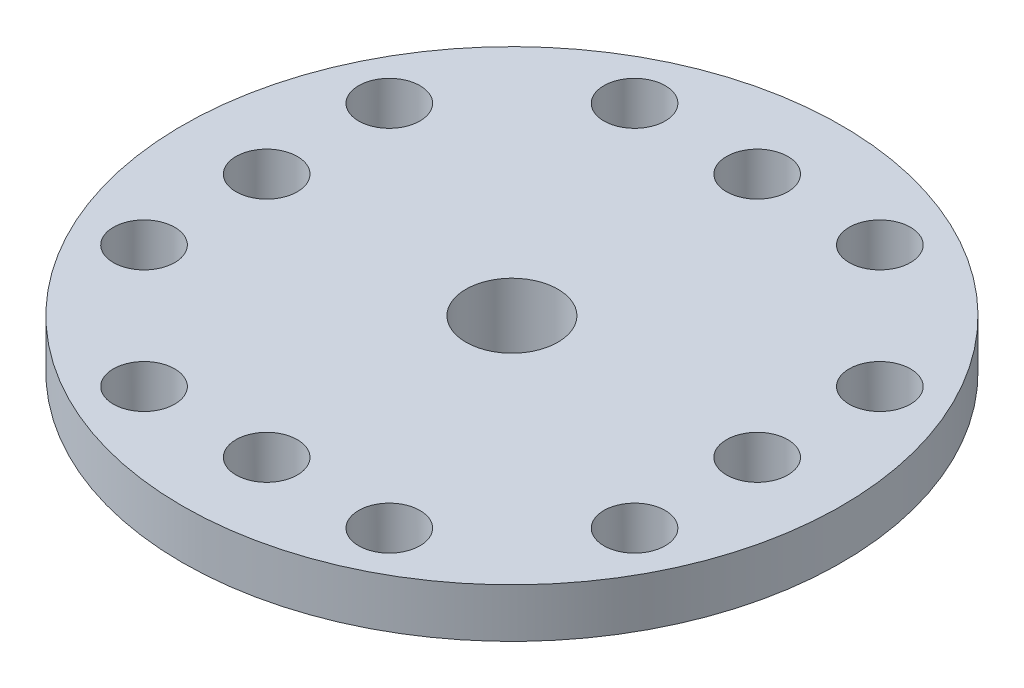
ISO-10303-21;
HEADER;
FILE_DESCRIPTION(('STEP AP214'),'2;1');
FILE_NAME('part.step','',(''),(''),'','','');
FILE_SCHEMA(('AUTOMOTIVE_DESIGN { 1 0 10303 214 1 1 1 1 }'));
ENDSEC;
DATA;
#1=APPLICATION_CONTEXT('core data for automotive mechanical design processes');
#2=APPLICATION_PROTOCOL_DEFINITION('international standard','automotive_design',2000,#1);
#3=PRODUCT_CONTEXT('',#1,'mechanical');
#4=PRODUCT('Part','Part','',(#3));
#5=PRODUCT_RELATED_PRODUCT_CATEGORY('part','',(#4));
#6=PRODUCT_DEFINITION_FORMATION('','',#4);
#7=PRODUCT_DEFINITION_CONTEXT('part definition',#1,'design');
#8=PRODUCT_DEFINITION('design','',#6,#7);
#9=PRODUCT_DEFINITION_SHAPE('','',#8);
#10=(LENGTH_UNIT() NAMED_UNIT(*) SI_UNIT(.MILLI.,.METRE.));
#11=(NAMED_UNIT(*) PLANE_ANGLE_UNIT() SI_UNIT($,.RADIAN.));
#12=(NAMED_UNIT(*) SI_UNIT($,.STERADIAN.) SOLID_ANGLE_UNIT());
#13=UNCERTAINTY_MEASURE_WITH_UNIT(LENGTH_MEASURE(1.E-05),#10,'distance_accuracy_value','');
#14=(GEOMETRIC_REPRESENTATION_CONTEXT(3) GLOBAL_UNCERTAINTY_ASSIGNED_CONTEXT((#13)) GLOBAL_UNIT_ASSIGNED_CONTEXT((#10,
#11,#12)) REPRESENTATION_CONTEXT('',''));
#15=CARTESIAN_POINT('',(0.,0.,0.));
#16=DIRECTION('',(0.,0.,1.));
#17=DIRECTION('',(1.,0.,0.));
#18=AXIS2_PLACEMENT_3D('',#15,#16,#17);
#19=CARTESIAN_POINT('',(0.,0.,0.));
#20=DIRECTION('',(0.,1.,0.));
#21=DIRECTION('',(0.,0.,1.));
#22=AXIS2_PLACEMENT_3D('',#19,#20,#21);
#23=CYLINDRICAL_SURFACE('',#22,1.25);
#24=CARTESIAN_POINT('',(0.,4.5,0.));
#25=DIRECTION('',(0.,1.,0.));
#26=DIRECTION('',(0.,0.,1.));
#27=AXIS2_PLACEMENT_3D('',#24,#25,#26);
#28=CIRCLE('',#27,1.25);
#29=CARTESIAN_POINT('',(0.,4.5,1.25));
#30=VERTEX_POINT('',#29);
#31=EDGE_CURVE('E50',#30,#30,#28,.F.);
#32=ORIENTED_EDGE('',*,*,#31,.F.);
#33=EDGE_LOOP('',(#32));
#34=FACE_BOUND('',#33,.T.);
#35=CARTESIAN_POINT('',(0.,3.5,0.));
#36=DIRECTION('',(0.,-1.,0.));
#37=DIRECTION('',(0.,0.,-1.));
#38=AXIS2_PLACEMENT_3D('',#35,#36,#37);
#39=CIRCLE('',#38,1.25);
#40=CARTESIAN_POINT('',(0.,3.5,-1.25));
#41=VERTEX_POINT('',#40);
#42=EDGE_CURVE('E36',#41,#41,#39,.F.);
#43=ORIENTED_EDGE('',*,*,#42,.F.);
#44=EDGE_LOOP('',(#43));
#45=FACE_BOUND('',#44,.T.);
#46=ADVANCED_FACE('F32',(#34,#45),#23,.F.);
#47=CARTESIAN_POINT('',(0.,7.5,0.));
#48=DIRECTION('',(0.,-1.,0.));
#49=DIRECTION('',(0.,0.,-1.));
#50=AXIS2_PLACEMENT_3D('',#47,#48,#49);
#51=CYLINDRICAL_SURFACE('',#50,6.);
#52=CARTESIAN_POINT('',(0.,7.5,0.));
#53=DIRECTION('',(0.,1.,0.));
#54=DIRECTION('',(0.,0.,1.));
#55=AXIS2_PLACEMENT_3D('',#52,#53,#54);
#56=CIRCLE('',#55,6.);
#57=CARTESIAN_POINT('',(0.,7.5,6.));
#58=VERTEX_POINT('',#57);
#59=EDGE_CURVE('E10',#58,#58,#56,.T.);
#60=ORIENTED_EDGE('',*,*,#59,.F.);
#61=EDGE_LOOP('',(#60));
#62=FACE_BOUND('',#61,.T.);
#63=CARTESIAN_POINT('',(0.,0.,0.));
#64=DIRECTION('',(0.,1.,0.));
#65=DIRECTION('',(0.,0.,1.));
#66=AXIS2_PLACEMENT_3D('',#63,#64,#65);
#67=CIRCLE('',#66,6.);
#68=CARTESIAN_POINT('',(0.,0.,6.));
#69=VERTEX_POINT('',#68);
#70=EDGE_CURVE('E40',#69,#69,#67,.T.);
#71=ORIENTED_EDGE('',*,*,#70,.T.);
#72=EDGE_LOOP('',(#71));
#73=FACE_BOUND('',#72,.T.);
#74=ADVANCED_FACE('F34',(#62,#73),#51,.T.);
#75=CARTESIAN_POINT('',(0.,0.,0.));
#76=DIRECTION('',(0.,1.,0.));
#77=DIRECTION('',(0.,0.,1.));
#78=AXIS2_PLACEMENT_3D('',#75,#76,#77);
#79=PLANE('',#78);
#80=CARTESIAN_POINT('',(0.,0.,0.));
#81=DIRECTION('',(0.,-1.,0.));
#82=DIRECTION('',(0.,0.,-1.));
#83=AXIS2_PLACEMENT_3D('',#80,#81,#82);
#84=CIRCLE('',#83,3.);
#85=CARTESIAN_POINT('',(0.,0.,-3.));
#86=VERTEX_POINT('',#85);
#87=EDGE_CURVE('E67',#86,#86,#84,.T.);
#88=ORIENTED_EDGE('',*,*,#87,.F.);
#89=EDGE_LOOP('',(#88));
#90=FACE_BOUND('',#89,.T.);
#91=ORIENTED_EDGE('',*,*,#70,.F.);
#92=EDGE_LOOP('',(#91));
#93=FACE_BOUND('',#92,.T.);
#94=ADVANCED_FACE('F147',(#90,#93),#79,.F.);
#95=CARTESIAN_POINT('',(0.,7.5,0.));
#96=DIRECTION('',(0.,1.,0.));
#97=DIRECTION('',(0.,0.,1.));
#98=AXIS2_PLACEMENT_3D('',#95,#96,#97);
#99=PLANE('',#98);
#100=CARTESIAN_POINT('',(15.9999999999999,7.5,-8.00000000000017));
#101=DIRECTION('',(0.,1.,0.));
#102=DIRECTION('',(0.,0.,1.));
#103=AXIS2_PLACEMENT_3D('',#100,#101,#102);
#104=CIRCLE('',#103,2.);
#105=CARTESIAN_POINT('',(15.9999999999999,7.5,-6.00000000000017));
#106=VERTEX_POINT('',#105);
#107=EDGE_CURVE('E57',#106,#106,#104,.T.);
#108=ORIENTED_EDGE('',*,*,#107,.T.);
#109=EDGE_LOOP('',(#108));
#110=FACE_BOUND('',#109,.T.);
#111=CARTESIAN_POINT('',(16.0000000000001,7.5,7.99999999999983));
#112=DIRECTION('',(0.,1.,0.));
#113=DIRECTION('',(0.,0.,1.));
#114=AXIS2_PLACEMENT_3D('',#111,#112,#113);
#115=CIRCLE('',#114,2.);
#116=CARTESIAN_POINT('',(16.0000000000001,7.5,9.99999999999983));
#117=VERTEX_POINT('',#116);
#118=EDGE_CURVE('E75',#117,#117,#115,.T.);
#119=ORIENTED_EDGE('',*,*,#118,.T.);
#120=EDGE_LOOP('',(#119));
#121=FACE_BOUND('',#120,.T.);
#122=CARTESIAN_POINT('',(16.,7.5,-1.65955442947404E-13));
#123=DIRECTION('',(0.,1.,0.));
#124=DIRECTION('',(0.,0.,1.));
#125=AXIS2_PLACEMENT_3D('',#122,#123,#124);
#126=CIRCLE('',#125,2.);
#127=CARTESIAN_POINT('',(16.,7.5,1.99999999999983));
#128=VERTEX_POINT('',#127);
#129=EDGE_CURVE('E81',#128,#128,#126,.T.);
#130=ORIENTED_EDGE('',*,*,#129,.T.);
#131=EDGE_LOOP('',(#130));
#132=FACE_BOUND('',#131,.T.);
#133=CARTESIAN_POINT('',(8.,7.5,16.));
#134=DIRECTION('',(0.,1.,0.));
#135=DIRECTION('',(0.,0.,1.));
#136=AXIS2_PLACEMENT_3D('',#133,#134,#135);
#137=CIRCLE('',#136,2.);
#138=CARTESIAN_POINT('',(8.,7.5,18.));
#139=VERTEX_POINT('',#138);
#140=EDGE_CURVE('E87',#139,#139,#137,.T.);
#141=ORIENTED_EDGE('',*,*,#140,.T.);
#142=EDGE_LOOP('',(#141));
#143=FACE_BOUND('',#142,.T.);
#144=CARTESIAN_POINT('',(-8.,7.5,16.));
#145=DIRECTION('',(0.,1.,0.));
#146=DIRECTION('',(0.,0.,1.));
#147=AXIS2_PLACEMENT_3D('',#144,#145,#146);
#148=CIRCLE('',#147,2.);
#149=CARTESIAN_POINT('',(-8.,7.5,18.));
#150=VERTEX_POINT('',#149);
#151=EDGE_CURVE('E93',#150,#150,#148,.T.);
#152=ORIENTED_EDGE('',*,*,#151,.T.);
#153=EDGE_LOOP('',(#152));
#154=FACE_BOUND('',#153,.T.);
#155=CARTESIAN_POINT('',(0.,7.5,16.));
#156=DIRECTION('',(0.,1.,0.));
#157=DIRECTION('',(0.,0.,1.));
#158=AXIS2_PLACEMENT_3D('',#155,#156,#157);
#159=CIRCLE('',#158,2.);
#160=CARTESIAN_POINT('',(0.,7.5,18.));
#161=VERTEX_POINT('',#160);
#162=EDGE_CURVE('E99',#161,#161,#159,.T.);
#163=ORIENTED_EDGE('',*,*,#162,.T.);
#164=EDGE_LOOP('',(#163));
#165=FACE_BOUND('',#164,.T.);
#166=CARTESIAN_POINT('',(-16.,7.5,8.00000000000005));
#167=DIRECTION('',(0.,1.,0.));
#168=DIRECTION('',(0.,0.,1.));
#169=AXIS2_PLACEMENT_3D('',#166,#167,#168);
#170=CIRCLE('',#169,2.);
#171=CARTESIAN_POINT('',(-16.,7.5,10.0000000000001));
#172=VERTEX_POINT('',#171);
#173=EDGE_CURVE('E105',#172,#172,#170,.T.);
#174=ORIENTED_EDGE('',*,*,#173,.T.);
#175=EDGE_LOOP('',(#174));
#176=FACE_BOUND('',#175,.T.);
#177=CARTESIAN_POINT('',(-16.,7.5,-7.99999999999995));
#178=DIRECTION('',(0.,1.,0.));
#179=DIRECTION('',(0.,0.,1.));
#180=AXIS2_PLACEMENT_3D('',#177,#178,#179);
#181=CIRCLE('',#180,2.);
#182=CARTESIAN_POINT('',(-16.,7.5,-5.99999999999995));
#183=VERTEX_POINT('',#182);
#184=EDGE_CURVE('E111',#183,#183,#181,.T.);
#185=ORIENTED_EDGE('',*,*,#184,.T.);
#186=EDGE_LOOP('',(#185));
#187=FACE_BOUND('',#186,.T.);
#188=CARTESIAN_POINT('',(-16.,7.5,0.));
#189=DIRECTION('',(0.,1.,0.));
#190=DIRECTION('',(0.,0.,1.));
#191=AXIS2_PLACEMENT_3D('',#188,#189,#190);
#192=CIRCLE('',#191,2.);
#193=CARTESIAN_POINT('',(-16.,7.5,2.00000000000005));
#194=VERTEX_POINT('',#193);
#195=EDGE_CURVE('E117',#194,#194,#192,.T.);
#196=ORIENTED_EDGE('',*,*,#195,.T.);
#197=EDGE_LOOP('',(#196));
#198=FACE_BOUND('',#197,.T.);
#199=CARTESIAN_POINT('',(-8.,7.5,-16.));
#200=DIRECTION('',(0.,1.,0.));
#201=DIRECTION('',(0.,0.,1.));
#202=AXIS2_PLACEMENT_3D('',#199,#200,#201);
#203=CIRCLE('',#202,2.);
#204=CARTESIAN_POINT('',(-8.,7.5,-14.));
#205=VERTEX_POINT('',#204);
#206=EDGE_CURVE('E123',#205,#205,#203,.T.);
#207=ORIENTED_EDGE('',*,*,#206,.T.);
#208=EDGE_LOOP('',(#207));
#209=FACE_BOUND('',#208,.T.);
#210=CARTESIAN_POINT('',(8.,7.5,-16.));
#211=DIRECTION('',(0.,1.,0.));
#212=DIRECTION('',(0.,0.,1.));
#213=AXIS2_PLACEMENT_3D('',#210,#211,#212);
#214=CIRCLE('',#213,2.);
#215=CARTESIAN_POINT('',(8.,7.5,-14.));
#216=VERTEX_POINT('',#215);
#217=EDGE_CURVE('E129',#216,#216,#214,.T.);
#218=ORIENTED_EDGE('',*,*,#217,.T.);
#219=EDGE_LOOP('',(#218));
#220=FACE_BOUND('',#219,.T.);
#221=CARTESIAN_POINT('',(0.,7.5,-16.));
#222=DIRECTION('',(0.,1.,0.));
#223=DIRECTION('',(0.,0.,1.));
#224=AXIS2_PLACEMENT_3D('',#221,#222,#223);
#225=CIRCLE('',#224,2.);
#226=CARTESIAN_POINT('',(0.,7.5,-14.));
#227=VERTEX_POINT('',#226);
#228=EDGE_CURVE('E135',#227,#227,#225,.T.);
#229=ORIENTED_EDGE('',*,*,#228,.T.);
#230=EDGE_LOOP('',(#229));
#231=FACE_BOUND('',#230,.T.);
#232=CARTESIAN_POINT('',(0.,7.5,0.));
#233=DIRECTION('',(0.,1.,0.));
#234=DIRECTION('',(0.,0.,1.));
#235=AXIS2_PLACEMENT_3D('',#232,#233,#234);
#236=CIRCLE('',#235,21.5);
#237=CARTESIAN_POINT('',(0.,7.5,21.5));
#238=VERTEX_POINT('',#237);
#239=EDGE_CURVE('E48',#238,#238,#236,.T.);
#240=ORIENTED_EDGE('',*,*,#239,.F.);
#241=EDGE_LOOP('',(#240));
#242=FACE_BOUND('',#241,.T.);
#243=ORIENTED_EDGE('',*,*,#59,.T.);
#244=EDGE_LOOP('',(#243));
#245=FACE_BOUND('',#244,.T.);
#246=ADVANCED_FACE('F145',(#110,#121,#132,#143,#154,#165,#176,#187,#198,#209,#220,#231,#242,
#245),#99,.F.);
#247=CARTESIAN_POINT('',(0.,10.7,0.));
#248=DIRECTION('',(0.,-1.,0.));
#249=DIRECTION('',(0.,0.,-1.));
#250=AXIS2_PLACEMENT_3D('',#247,#248,#249);
#251=CYLINDRICAL_SURFACE('',#250,21.5);
#252=CARTESIAN_POINT('',(0.,10.7,0.));
#253=DIRECTION('',(0.,1.,0.));
#254=DIRECTION('',(0.,0.,1.));
#255=AXIS2_PLACEMENT_3D('',#252,#253,#254);
#256=CIRCLE('',#255,21.5);
#257=CARTESIAN_POINT('',(0.,10.7,21.5));
#258=VERTEX_POINT('',#257);
#259=EDGE_CURVE('E45',#258,#258,#256,.T.);
#260=ORIENTED_EDGE('',*,*,#259,.F.);
#261=EDGE_LOOP('',(#260));
#262=FACE_BOUND('',#261,.T.);
#263=ORIENTED_EDGE('',*,*,#239,.T.);
#264=EDGE_LOOP('',(#263));
#265=FACE_BOUND('',#264,.T.);
#266=ADVANCED_FACE('F143',(#262,#265),#251,.T.);
#267=CARTESIAN_POINT('',(0.,10.7,0.));
#268=DIRECTION('',(0.,1.,0.));
#269=DIRECTION('',(0.,0.,1.));
#270=AXIS2_PLACEMENT_3D('',#267,#268,#269);
#271=PLANE('',#270);
#272=CARTESIAN_POINT('',(0.,10.7,0.));
#273=DIRECTION('',(0.,1.,0.));
#274=DIRECTION('',(0.,0.,1.));
#275=AXIS2_PLACEMENT_3D('',#272,#273,#274);
#276=CIRCLE('',#275,3.);
#277=CARTESIAN_POINT('',(0.,10.7,3.));
#278=VERTEX_POINT('',#277);
#279=EDGE_CURVE('E60',#278,#278,#276,.T.);
#280=ORIENTED_EDGE('',*,*,#279,.F.);
#281=EDGE_LOOP('',(#280));
#282=FACE_BOUND('',#281,.T.);
#283=CARTESIAN_POINT('',(15.9999999999999,10.7,-8.00000000000017));
#284=DIRECTION('',(0.,1.,0.));
#285=DIRECTION('',(-1.,0.,0.));
#286=AXIS2_PLACEMENT_3D('',#283,#284,#285);
#287=CIRCLE('',#286,2.);
#288=CARTESIAN_POINT('',(13.9999999999999,10.7,-8.00000000000015));
#289=VERTEX_POINT('',#288);
#290=EDGE_CURVE('E52',#289,#289,#287,.T.);
#291=ORIENTED_EDGE('',*,*,#290,.F.);
#292=EDGE_LOOP('',(#291));
#293=FACE_BOUND('',#292,.T.);
#294=CARTESIAN_POINT('',(16.0000000000001,10.7,7.99999999999983));
#295=DIRECTION('',(0.,1.,0.));
#296=DIRECTION('',(-1.,0.,0.));
#297=AXIS2_PLACEMENT_3D('',#294,#295,#296);
#298=CIRCLE('',#297,2.);
#299=CARTESIAN_POINT('',(14.0000000000001,10.7,7.99999999999985));
#300=VERTEX_POINT('',#299);
#301=EDGE_CURVE('E72',#300,#300,#298,.T.);
#302=ORIENTED_EDGE('',*,*,#301,.F.);
#303=EDGE_LOOP('',(#302));
#304=FACE_BOUND('',#303,.T.);
#305=CARTESIAN_POINT('',(16.,10.7,-1.65955442947404E-13));
#306=DIRECTION('',(0.,1.,0.));
#307=DIRECTION('',(-1.,0.,0.));
#308=AXIS2_PLACEMENT_3D('',#305,#306,#307);
#309=CIRCLE('',#308,2.);
#310=CARTESIAN_POINT('',(14.,10.7,-1.45006554914345E-13));
#311=VERTEX_POINT('',#310);
#312=EDGE_CURVE('E78',#311,#311,#309,.T.);
#313=ORIENTED_EDGE('',*,*,#312,.F.);
#314=EDGE_LOOP('',(#313));
#315=FACE_BOUND('',#314,.T.);
#316=CARTESIAN_POINT('',(8.,10.7,16.));
#317=DIRECTION('',(0.,1.,0.));
#318=DIRECTION('',(0.,0.,-1.));
#319=AXIS2_PLACEMENT_3D('',#316,#317,#318);
#320=CIRCLE('',#319,2.);
#321=CARTESIAN_POINT('',(8.,10.7,14.));
#322=VERTEX_POINT('',#321);
#323=EDGE_CURVE('E84',#322,#322,#320,.T.);
#324=ORIENTED_EDGE('',*,*,#323,.F.);
#325=EDGE_LOOP('',(#324));
#326=FACE_BOUND('',#325,.T.);
#327=CARTESIAN_POINT('',(-8.,10.7,16.));
#328=DIRECTION('',(0.,1.,0.));
#329=DIRECTION('',(0.,0.,-1.));
#330=AXIS2_PLACEMENT_3D('',#327,#328,#329);
#331=CIRCLE('',#330,2.);
#332=CARTESIAN_POINT('',(-8.,10.7,14.));
#333=VERTEX_POINT('',#332);
#334=EDGE_CURVE('E90',#333,#333,#331,.T.);
#335=ORIENTED_EDGE('',*,*,#334,.F.);
#336=EDGE_LOOP('',(#335));
#337=FACE_BOUND('',#336,.T.);
#338=CARTESIAN_POINT('',(0.,10.7,16.));
#339=DIRECTION('',(0.,1.,0.));
#340=DIRECTION('',(0.,0.,-1.));
#341=AXIS2_PLACEMENT_3D('',#338,#339,#340);
#342=CIRCLE('',#341,2.);
#343=CARTESIAN_POINT('',(0.,10.7,14.));
#344=VERTEX_POINT('',#343);
#345=EDGE_CURVE('E96',#344,#344,#342,.T.);
#346=ORIENTED_EDGE('',*,*,#345,.F.);
#347=EDGE_LOOP('',(#346));
#348=FACE_BOUND('',#347,.T.);
#349=CARTESIAN_POINT('',(-16.,10.7,8.00000000000005));
#350=DIRECTION('',(0.,1.,0.));
#351=DIRECTION('',(1.,0.,0.));
#352=AXIS2_PLACEMENT_3D('',#349,#350,#351);
#353=CIRCLE('',#352,2.);
#354=CARTESIAN_POINT('',(-14.,10.7,8.00000000000005));
#355=VERTEX_POINT('',#354);
#356=EDGE_CURVE('E102',#355,#355,#353,.T.);
#357=ORIENTED_EDGE('',*,*,#356,.F.);
#358=EDGE_LOOP('',(#357));
#359=FACE_BOUND('',#358,.T.);
#360=CARTESIAN_POINT('',(-16.,10.7,-7.99999999999995));
#361=DIRECTION('',(0.,1.,0.));
#362=DIRECTION('',(1.,0.,0.));
#363=AXIS2_PLACEMENT_3D('',#360,#361,#362);
#364=CIRCLE('',#363,2.);
#365=CARTESIAN_POINT('',(-14.,10.7,-7.99999999999995));
#366=VERTEX_POINT('',#365);
#367=EDGE_CURVE('E108',#366,#366,#364,.T.);
#368=ORIENTED_EDGE('',*,*,#367,.F.);
#369=EDGE_LOOP('',(#368));
#370=FACE_BOUND('',#369,.T.);
#371=CARTESIAN_POINT('',(-16.,10.7,0.));
#372=DIRECTION('',(0.,1.,0.));
#373=DIRECTION('',(1.,0.,0.));
#374=AXIS2_PLACEMENT_3D('',#371,#372,#373);
#375=CIRCLE('',#374,2.);
#376=CARTESIAN_POINT('',(-14.,10.7,0.));
#377=VERTEX_POINT('',#376);
#378=EDGE_CURVE('E114',#377,#377,#375,.T.);
#379=ORIENTED_EDGE('',*,*,#378,.F.);
#380=EDGE_LOOP('',(#379));
#381=FACE_BOUND('',#380,.T.);
#382=CARTESIAN_POINT('',(-8.,10.7,-16.));
#383=DIRECTION('',(0.,1.,0.));
#384=DIRECTION('',(0.,0.,1.));
#385=AXIS2_PLACEMENT_3D('',#382,#383,#384);
#386=CIRCLE('',#385,2.);
#387=CARTESIAN_POINT('',(-8.,10.7,-14.));
#388=VERTEX_POINT('',#387);
#389=EDGE_CURVE('E120',#388,#388,#386,.T.);
#390=ORIENTED_EDGE('',*,*,#389,.F.);
#391=EDGE_LOOP('',(#390));
#392=FACE_BOUND('',#391,.T.);
#393=CARTESIAN_POINT('',(8.,10.7,-16.));
#394=DIRECTION('',(0.,1.,0.));
#395=DIRECTION('',(0.,0.,1.));
#396=AXIS2_PLACEMENT_3D('',#393,#394,#395);
#397=CIRCLE('',#396,2.);
#398=CARTESIAN_POINT('',(8.,10.7,-14.));
#399=VERTEX_POINT('',#398);
#400=EDGE_CURVE('E126',#399,#399,#397,.T.);
#401=ORIENTED_EDGE('',*,*,#400,.F.);
#402=EDGE_LOOP('',(#401));
#403=FACE_BOUND('',#402,.T.);
#404=CARTESIAN_POINT('',(0.,10.7,-16.));
#405=DIRECTION('',(0.,1.,0.));
#406=DIRECTION('',(0.,0.,1.));
#407=AXIS2_PLACEMENT_3D('',#404,#405,#406);
#408=CIRCLE('',#407,2.);
#409=CARTESIAN_POINT('',(0.,10.7,-14.));
#410=VERTEX_POINT('',#409);
#411=EDGE_CURVE('E132',#410,#410,#408,.T.);
#412=ORIENTED_EDGE('',*,*,#411,.F.);
#413=EDGE_LOOP('',(#412));
#414=FACE_BOUND('',#413,.T.);
#415=ORIENTED_EDGE('',*,*,#259,.T.);
#416=EDGE_LOOP('',(#415));
#417=FACE_BOUND('',#416,.T.);
#418=ADVANCED_FACE('F154',(#282,#293,#304,#315,#326,#337,#348,#359,#370,#381,#392,#403,#414,
#417),#271,.T.);
#419=CARTESIAN_POINT('',(0.,0.,-16.));
#420=DIRECTION('',(0.,1.,0.));
#421=DIRECTION('',(0.,0.,1.));
#422=AXIS2_PLACEMENT_3D('',#419,#420,#421);
#423=CYLINDRICAL_SURFACE('',#422,2.);
#424=ORIENTED_EDGE('',*,*,#411,.T.);
#425=EDGE_LOOP('',(#424));
#426=FACE_BOUND('',#425,.T.);
#427=ORIENTED_EDGE('',*,*,#228,.F.);
#428=EDGE_LOOP('',(#427));
#429=FACE_BOUND('',#428,.T.);
#430=ADVANCED_FACE('F179',(#426,#429),#423,.F.);
#431=CARTESIAN_POINT('',(8.,0.,-16.));
#432=DIRECTION('',(0.,1.,0.));
#433=DIRECTION('',(0.,0.,1.));
#434=AXIS2_PLACEMENT_3D('',#431,#432,#433);
#435=CYLINDRICAL_SURFACE('',#434,2.);
#436=ORIENTED_EDGE('',*,*,#400,.T.);
#437=EDGE_LOOP('',(#436));
#438=FACE_BOUND('',#437,.T.);
#439=ORIENTED_EDGE('',*,*,#217,.F.);
#440=EDGE_LOOP('',(#439));
#441=FACE_BOUND('',#440,.T.);
#442=ADVANCED_FACE('F175',(#438,#441),#435,.F.);
#443=CARTESIAN_POINT('',(-8.,0.,-16.));
#444=DIRECTION('',(0.,1.,0.));
#445=DIRECTION('',(0.,0.,1.));
#446=AXIS2_PLACEMENT_3D('',#443,#444,#445);
#447=CYLINDRICAL_SURFACE('',#446,2.);
#448=ORIENTED_EDGE('',*,*,#389,.T.);
#449=EDGE_LOOP('',(#448));
#450=FACE_BOUND('',#449,.T.);
#451=ORIENTED_EDGE('',*,*,#206,.F.);
#452=EDGE_LOOP('',(#451));
#453=FACE_BOUND('',#452,.T.);
#454=ADVANCED_FACE('F172',(#450,#453),#447,.F.);
#455=CARTESIAN_POINT('',(-16.,0.,0.));
#456=DIRECTION('',(0.,1.,0.));
#457=DIRECTION('',(0.,0.,1.));
#458=AXIS2_PLACEMENT_3D('',#455,#456,#457);
#459=CYLINDRICAL_SURFACE('',#458,2.);
#460=ORIENTED_EDGE('',*,*,#378,.T.);
#461=EDGE_LOOP('',(#460));
#462=FACE_BOUND('',#461,.T.);
#463=ORIENTED_EDGE('',*,*,#195,.F.);
#464=EDGE_LOOP('',(#463));
#465=FACE_BOUND('',#464,.T.);
#466=ADVANCED_FACE('F170',(#462,#465),#459,.F.);
#467=CARTESIAN_POINT('',(-16.,0.,-7.99999999999995));
#468=DIRECTION('',(0.,1.,0.));
#469=DIRECTION('',(0.,0.,1.));
#470=AXIS2_PLACEMENT_3D('',#467,#468,#469);
#471=CYLINDRICAL_SURFACE('',#470,2.);
#472=ORIENTED_EDGE('',*,*,#367,.T.);
#473=EDGE_LOOP('',(#472));
#474=FACE_BOUND('',#473,.T.);
#475=ORIENTED_EDGE('',*,*,#184,.F.);
#476=EDGE_LOOP('',(#475));
#477=FACE_BOUND('',#476,.T.);
#478=ADVANCED_FACE('F224',(#474,#477),#471,.F.);
#479=CARTESIAN_POINT('',(-16.,0.,8.00000000000005));
#480=DIRECTION('',(0.,1.,0.));
#481=DIRECTION('',(0.,0.,1.));
#482=AXIS2_PLACEMENT_3D('',#479,#480,#481);
#483=CYLINDRICAL_SURFACE('',#482,2.);
#484=ORIENTED_EDGE('',*,*,#356,.T.);
#485=EDGE_LOOP('',(#484));
#486=FACE_BOUND('',#485,.T.);
#487=ORIENTED_EDGE('',*,*,#173,.F.);
#488=EDGE_LOOP('',(#487));
#489=FACE_BOUND('',#488,.T.);
#490=ADVANCED_FACE('F230',(#486,#489),#483,.F.);
#491=CARTESIAN_POINT('',(0.,0.,16.));
#492=DIRECTION('',(0.,1.,0.));
#493=DIRECTION('',(0.,0.,1.));
#494=AXIS2_PLACEMENT_3D('',#491,#492,#493);
#495=CYLINDRICAL_SURFACE('',#494,2.);
#496=ORIENTED_EDGE('',*,*,#345,.T.);
#497=EDGE_LOOP('',(#496));
#498=FACE_BOUND('',#497,.T.);
#499=ORIENTED_EDGE('',*,*,#162,.F.);
#500=EDGE_LOOP('',(#499));
#501=FACE_BOUND('',#500,.T.);
#502=ADVANCED_FACE('F235',(#498,#501),#495,.F.);
#503=CARTESIAN_POINT('',(-8.,0.,16.));
#504=DIRECTION('',(0.,1.,0.));
#505=DIRECTION('',(0.,0.,1.));
#506=AXIS2_PLACEMENT_3D('',#503,#504,#505);
#507=CYLINDRICAL_SURFACE('',#506,2.);
#508=ORIENTED_EDGE('',*,*,#334,.T.);
#509=EDGE_LOOP('',(#508));
#510=FACE_BOUND('',#509,.T.);
#511=ORIENTED_EDGE('',*,*,#151,.F.);
#512=EDGE_LOOP('',(#511));
#513=FACE_BOUND('',#512,.T.);
#514=ADVANCED_FACE('F242',(#510,#513),#507,.F.);
#515=CARTESIAN_POINT('',(8.,0.,16.));
#516=DIRECTION('',(0.,1.,0.));
#517=DIRECTION('',(0.,0.,1.));
#518=AXIS2_PLACEMENT_3D('',#515,#516,#517);
#519=CYLINDRICAL_SURFACE('',#518,2.);
#520=ORIENTED_EDGE('',*,*,#323,.T.);
#521=EDGE_LOOP('',(#520));
#522=FACE_BOUND('',#521,.T.);
#523=ORIENTED_EDGE('',*,*,#140,.F.);
#524=EDGE_LOOP('',(#523));
#525=FACE_BOUND('',#524,.T.);
#526=ADVANCED_FACE('F246',(#522,#525),#519,.F.);
#527=CARTESIAN_POINT('',(16.,0.,-1.65955442947404E-13));
#528=DIRECTION('',(0.,1.,0.));
#529=DIRECTION('',(0.,0.,1.));
#530=AXIS2_PLACEMENT_3D('',#527,#528,#529);
#531=CYLINDRICAL_SURFACE('',#530,2.);
#532=ORIENTED_EDGE('',*,*,#312,.T.);
#533=EDGE_LOOP('',(#532));
#534=FACE_BOUND('',#533,.T.);
#535=ORIENTED_EDGE('',*,*,#129,.F.);
#536=EDGE_LOOP('',(#535));
#537=FACE_BOUND('',#536,.T.);
#538=ADVANCED_FACE('F250',(#534,#537),#531,.F.);
#539=CARTESIAN_POINT('',(16.0000000000001,0.,7.99999999999983));
#540=DIRECTION('',(0.,1.,0.));
#541=DIRECTION('',(0.,0.,1.));
#542=AXIS2_PLACEMENT_3D('',#539,#540,#541);
#543=CYLINDRICAL_SURFACE('',#542,2.);
#544=ORIENTED_EDGE('',*,*,#301,.T.);
#545=EDGE_LOOP('',(#544));
#546=FACE_BOUND('',#545,.T.);
#547=ORIENTED_EDGE('',*,*,#118,.F.);
#548=EDGE_LOOP('',(#547));
#549=FACE_BOUND('',#548,.T.);
#550=ADVANCED_FACE('F254',(#546,#549),#543,.F.);
#551=CARTESIAN_POINT('',(15.9999999999999,0.,-8.00000000000017));
#552=DIRECTION('',(0.,1.,0.));
#553=DIRECTION('',(0.,0.,1.));
#554=AXIS2_PLACEMENT_3D('',#551,#552,#553);
#555=CYLINDRICAL_SURFACE('',#554,2.);
#556=ORIENTED_EDGE('',*,*,#290,.T.);
#557=EDGE_LOOP('',(#556));
#558=FACE_BOUND('',#557,.T.);
#559=ORIENTED_EDGE('',*,*,#107,.F.);
#560=EDGE_LOOP('',(#559));
#561=FACE_BOUND('',#560,.T.);
#562=ADVANCED_FACE('F258',(#558,#561),#555,.F.);
#563=CARTESIAN_POINT('',(0.,4.5,0.));
#564=DIRECTION('',(0.,1.,0.));
#565=DIRECTION('',(0.,0.,1.));
#566=AXIS2_PLACEMENT_3D('',#563,#564,#565);
#567=PLANE('',#566);
#568=CARTESIAN_POINT('',(0.,4.5,0.));
#569=DIRECTION('',(0.,1.,0.));
#570=DIRECTION('',(0.,0.,1.));
#571=AXIS2_PLACEMENT_3D('',#568,#569,#570);
#572=CIRCLE('',#571,3.);
#573=CARTESIAN_POINT('',(0.,4.5,3.));
#574=VERTEX_POINT('',#573);
#575=EDGE_CURVE('E53',#574,#574,#572,.T.);
#576=ORIENTED_EDGE('',*,*,#575,.T.);
#577=EDGE_LOOP('',(#576));
#578=FACE_BOUND('',#577,.T.);
#579=ORIENTED_EDGE('',*,*,#31,.T.);
#580=EDGE_LOOP('',(#579));
#581=FACE_BOUND('',#580,.T.);
#582=ADVANCED_FACE('F262',(#578,#581),#567,.T.);
#583=CARTESIAN_POINT('',(0.,4.5,0.));
#584=DIRECTION('',(0.,1.,0.));
#585=DIRECTION('',(0.,0.,1.));
#586=AXIS2_PLACEMENT_3D('',#583,#584,#585);
#587=CYLINDRICAL_SURFACE('',#586,3.);
#588=ORIENTED_EDGE('',*,*,#575,.F.);
#589=EDGE_LOOP('',(#588));
#590=FACE_BOUND('',#589,.T.);
#591=ORIENTED_EDGE('',*,*,#279,.T.);
#592=EDGE_LOOP('',(#591));
#593=FACE_BOUND('',#592,.T.);
#594=ADVANCED_FACE('F264',(#590,#593),#587,.F.);
#595=CARTESIAN_POINT('',(0.,3.5,0.));
#596=DIRECTION('',(0.,-1.,0.));
#597=DIRECTION('',(0.,0.,-1.));
#598=AXIS2_PLACEMENT_3D('',#595,#596,#597);
#599=PLANE('',#598);
#600=CARTESIAN_POINT('',(0.,3.5,0.));
#601=DIRECTION('',(0.,-1.,0.));
#602=DIRECTION('',(0.,0.,-1.));
#603=AXIS2_PLACEMENT_3D('',#600,#601,#602);
#604=CIRCLE('',#603,3.);
#605=CARTESIAN_POINT('',(0.,3.5,-3.));
#606=VERTEX_POINT('',#605);
#607=EDGE_CURVE('E282',#606,#606,#604,.T.);
#608=ORIENTED_EDGE('',*,*,#607,.T.);
#609=EDGE_LOOP('',(#608));
#610=FACE_BOUND('',#609,.T.);
#611=ORIENTED_EDGE('',*,*,#42,.T.);
#612=EDGE_LOOP('',(#611));
#613=FACE_BOUND('',#612,.T.);
#614=ADVANCED_FACE('F267',(#610,#613),#599,.T.);
#615=CARTESIAN_POINT('',(0.,3.5,0.));
#616=DIRECTION('',(0.,-1.,0.));
#617=DIRECTION('',(0.,0.,-1.));
#618=AXIS2_PLACEMENT_3D('',#615,#616,#617);
#619=CYLINDRICAL_SURFACE('',#618,3.);
#620=ORIENTED_EDGE('',*,*,#607,.F.);
#621=EDGE_LOOP('',(#620));
#622=FACE_BOUND('',#621,.T.);
#623=ORIENTED_EDGE('',*,*,#87,.T.);
#624=EDGE_LOOP('',(#623));
#625=FACE_BOUND('',#624,.T.);
#626=ADVANCED_FACE('F271',(#622,#625),#619,.F.);
#627=CLOSED_SHELL('',(#46,#74,#94,#246,#266,#418,#430,#442,#454,#466,#478,#490,#502,#514,#526,
#538,#550,#562,#582,#594,#614,#626));
#628=MANIFOLD_SOLID_BREP('B2',#627);
#629=ADVANCED_BREP_SHAPE_REPRESENTATION('',(#18,#628),#14);
#630=SHAPE_DEFINITION_REPRESENTATION(#9,#629);
ENDSEC;
END-ISO-10303-21;
